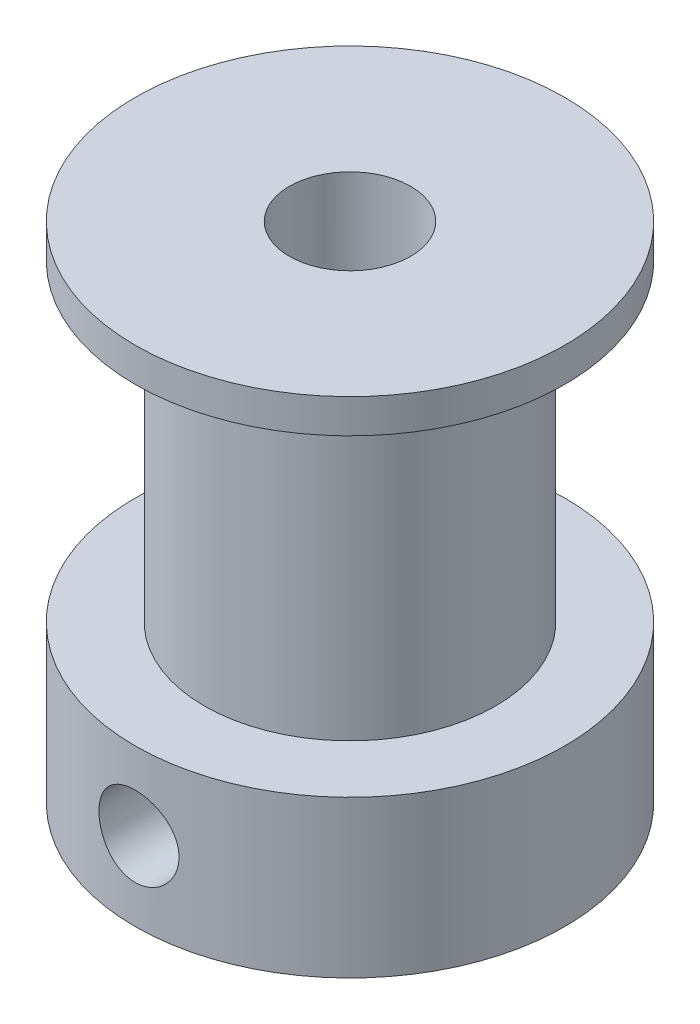
ISO-10303-21;
HEADER;
FILE_DESCRIPTION(('STEP AP214'),'2;1');
FILE_NAME('part.step','',(''),(''),'','','');
FILE_SCHEMA(('AUTOMOTIVE_DESIGN { 1 0 10303 214 1 1 1 1 }'));
ENDSEC;
DATA;
#1=APPLICATION_CONTEXT('core data for automotive mechanical design processes');
#2=APPLICATION_PROTOCOL_DEFINITION('international standard','automotive_design',2000,#1);
#3=PRODUCT_CONTEXT('',#1,'mechanical');
#4=PRODUCT('Part','Part','',(#3));
#5=PRODUCT_RELATED_PRODUCT_CATEGORY('part','',(#4));
#6=PRODUCT_DEFINITION_FORMATION('','',#4);
#7=PRODUCT_DEFINITION_CONTEXT('part definition',#1,'design');
#8=PRODUCT_DEFINITION('design','',#6,#7);
#9=PRODUCT_DEFINITION_SHAPE('','',#8);
#10=(LENGTH_UNIT() NAMED_UNIT(*) SI_UNIT(.MILLI.,.METRE.));
#11=(NAMED_UNIT(*) PLANE_ANGLE_UNIT() SI_UNIT($,.RADIAN.));
#12=(NAMED_UNIT(*) SI_UNIT($,.STERADIAN.) SOLID_ANGLE_UNIT());
#13=UNCERTAINTY_MEASURE_WITH_UNIT(LENGTH_MEASURE(1.E-05),#10,'distance_accuracy_value','');
#14=(GEOMETRIC_REPRESENTATION_CONTEXT(3) GLOBAL_UNCERTAINTY_ASSIGNED_CONTEXT((#13)) GLOBAL_UNIT_ASSIGNED_CONTEXT((#10,
#11,#12)) REPRESENTATION_CONTEXT('',''));
#15=CARTESIAN_POINT('',(0.,0.,0.));
#16=DIRECTION('',(0.,0.,1.));
#17=DIRECTION('',(1.,0.,0.));
#18=AXIS2_PLACEMENT_3D('',#15,#16,#17);
#19=CARTESIAN_POINT('',(0.,0.,0.));
#20=DIRECTION('',(0.,-1.,0.));
#21=DIRECTION('',(0.,0.,-1.));
#22=AXIS2_PLACEMENT_3D('',#19,#20,#21);
#23=CYLINDRICAL_SURFACE('',#22,2.5);
#24=CARTESIAN_POINT('',(-1.8781639970993,3.225,-1.65));
#25=CARTESIAN_POINT('',(-1.87817356740867,3.30579427655975,-1.64999443072167));
#26=CARTESIAN_POINT('',(-1.88347418282792,3.38662636905579,-1.64401449371116));
#27=CARTESIAN_POINT('',(-1.90365752241832,3.54541795060532,-1.62058860250623));
#28=CARTESIAN_POINT('',(-1.9185574504896,3.62337201591593,-1.60312206083479));
#29=CARTESIAN_POINT('',(-1.95530612756548,3.77363333158224,-1.55807727538571));
#30=CARTESIAN_POINT('',(-1.97708883218856,3.84598643150526,-1.53059477126484));
#31=CARTESIAN_POINT('',(-2.02503214275444,3.98494524738078,-1.46657517741326));
#32=CARTESIAN_POINT('',(-2.05119370638084,4.05154970122849,-1.43003610611277));
#33=CARTESIAN_POINT('',(-2.10971828562918,4.18821736687682,-1.342483593019));
#34=CARTESIAN_POINT('',(-2.14241946389367,4.25726727651007,-1.29011420470095));
#35=CARTESIAN_POINT('',(-2.20758221587981,4.38647714614391,-1.17514144468482));
#36=CARTESIAN_POINT('',(-2.24004353252863,4.44662860029669,-1.11252840012499));
#37=CARTESIAN_POINT('',(-2.3064419767716,4.56473271619889,-0.968234915676898));
#38=CARTESIAN_POINT('',(-2.33994640603816,4.62119090363769,-0.885111648041922));
#39=CARTESIAN_POINT('',(-2.39949293751456,4.71884115428655,-0.707908997031479));
#40=CARTESIAN_POINT('',(-2.42554320107045,4.76004992824281,-0.613841755901944));
#41=CARTESIAN_POINT('',(-2.46464353514927,4.82107361226671,-0.428365536633289));
#42=CARTESIAN_POINT('',(-2.47881191391302,4.84274914948944,-0.337811072451694));
#43=CARTESIAN_POINT('',(-2.49700266516609,4.87049014711654,-0.153380704926468));
#44=CARTESIAN_POINT('',(-2.50103745363967,4.87657471024375,-0.0595090091735767));
#45=CARTESIAN_POINT('',(-2.49868729659539,4.87300862462096,0.113712663637895));
#46=CARTESIAN_POINT('',(-2.49376656842582,4.86556933208685,0.193140500290932));
#47=CARTESIAN_POINT('',(-2.47671798966374,4.83953692457822,0.3493383081911));
#48=CARTESIAN_POINT('',(-2.46458960851095,4.8209429885018,0.426108083336214));
#49=CARTESIAN_POINT('',(-2.4341916732427,4.77358528412734,0.574862419576147));
#50=CARTESIAN_POINT('',(-2.41593946394568,4.74485022722838,0.646859815580448));
#51=CARTESIAN_POINT('',(-2.37464804586783,4.67831789592823,0.785017034503281));
#52=CARTESIAN_POINT('',(-2.35160793342518,4.64051891060689,0.851175752075152));
#53=CARTESIAN_POINT('',(-2.29902245001357,4.55144819163509,0.985047000791304));
#54=CARTESIAN_POINT('',(-2.26902056419845,4.49906230137878,1.05183695764555));
#55=CARTESIAN_POINT('',(-2.2070921891754,4.38519022775839,1.17625968695307));
#56=CARTESIAN_POINT('',(-2.17516278943165,4.32369006733423,1.2338781079658));
#57=CARTESIAN_POINT('',(-2.10711048312635,4.18250690257425,1.34724934289721));
#58=CARTESIAN_POINT('',(-2.07108428413496,4.10148069757491,1.40139996434746));
#59=CARTESIAN_POINT('',(-2.0043795765937,3.92947022283534,1.49525229324492));
#60=CARTESIAN_POINT('',(-1.973691925336,3.8385034211415,1.53497883258691));
#61=CARTESIAN_POINT('',(-1.93021206234819,3.67504901179961,1.58906609884216));
#62=CARTESIAN_POINT('',(-1.91481376393407,3.60458306194073,1.60742065844977));
#63=CARTESIAN_POINT('',(-1.89156962487726,3.46068483824098,1.63471528383588));
#64=CARTESIAN_POINT('',(-1.88371114115,3.38725774603094,1.64367111218457));
#65=CARTESIAN_POINT('',(-1.8767563549997,3.23913898103529,1.65161100823904));
#66=CARTESIAN_POINT('',(-1.87769482426888,3.16444345582033,1.65055550398266));
#67=CARTESIAN_POINT('',(-1.88825914723377,3.01646670785288,1.6384550878589));
#68=CARTESIAN_POINT('',(-1.89789215655036,2.94318670082213,1.62740194790476));
#69=CARTESIAN_POINT('',(-1.92377320788271,2.80315606994752,1.59670654181037));
#70=CARTESIAN_POINT('',(-1.9397182942886,2.7362601566981,1.57745493961547));
#71=CARTESIAN_POINT('',(-1.97637475195715,2.60658821030647,1.53127715983157));
#72=CARTESIAN_POINT('',(-1.99708770330354,2.54381355184297,1.50434843731629));
#73=CARTESIAN_POINT('',(-2.04592024038531,2.41084653371123,1.43744371796295));
#74=CARTESIAN_POINT('',(-2.0746933834994,2.34166627761783,1.3959374151933));
#75=CARTESIAN_POINT('',(-2.13386307226145,2.2104540035836,1.30370192953132));
#76=CARTESIAN_POINT('',(-2.16426156090022,2.14843083426984,1.2529615255776));
#77=CARTESIAN_POINT('',(-2.23066104299162,2.02002279309447,1.13132559349666));
#78=CARTESIAN_POINT('',(-2.26650752858329,1.95542825569478,1.0584336843705));
#79=CARTESIAN_POINT('',(-2.33354741548986,1.83929294484175,0.901029136145232));
#80=CARTESIAN_POINT('',(-2.36474520160667,1.78773983785047,0.816527594120797));
#81=CARTESIAN_POINT('',(-2.41383928477658,1.70846296196824,0.655022436944607));
#82=CARTESIAN_POINT('',(-2.43314294605933,1.67805320616478,0.579766982761487));
#83=CARTESIAN_POINT('',(-2.46500344203446,1.62840770004291,0.424305717798088));
#84=CARTESIAN_POINT('',(-2.47756592552064,1.60916259316718,0.344104114697706));
#85=CARTESIAN_POINT('',(-2.49483359194805,1.58280779187866,0.180532057501464));
#86=CARTESIAN_POINT('',(-2.49950622522129,1.57574836698325,0.0971499203467964));
#87=CARTESIAN_POINT('',(-2.50041880991432,1.57436521725825,-0.0697703046886496));
#88=CARTESIAN_POINT('',(-2.49665914509096,1.58004091284884,-0.153308385299506));
#89=CARTESIAN_POINT('',(-2.48162224491363,1.60295948175331,-0.31224884206867));
#90=CARTESIAN_POINT('',(-2.47086791156197,1.61939826797345,-0.387820405838241));
#91=CARTESIAN_POINT('',(-2.44325497490618,1.66222616352496,-0.534890956581204));
#92=CARTESIAN_POINT('',(-2.4263954123254,1.68861683656131,-0.606389301510793));
#93=CARTESIAN_POINT('',(-2.38659098522815,1.75225696718865,-0.748299731070002));
#94=CARTESIAN_POINT('',(-2.36333062488106,1.79008395318078,-0.818362050887261));
#95=CARTESIAN_POINT('',(-2.31298664760703,1.87460758414193,-0.951399734920284));
#96=CARTESIAN_POINT('',(-2.2859005630314,1.92130996063965,-1.0143704774724));
#97=CARTESIAN_POINT('',(-2.22528132748969,2.03052907515258,-1.14186276834818));
#98=CARTESIAN_POINT('',(-2.19140310364951,2.09437720174746,-1.20508031729177));
#99=CARTESIAN_POINT('',(-2.12387294022856,2.23156834044152,-1.32046767601713));
#100=CARTESIAN_POINT('',(-2.09022116132146,2.30491747200145,-1.37263030790415));
#101=CARTESIAN_POINT('',(-2.02963185186414,2.45297320198263,-1.46053735742483));
#102=CARTESIAN_POINT('',(-2.00236030827309,2.52689495776457,-1.49736813204505));
#103=CARTESIAN_POINT('',(-1.95397052678841,2.68110913288329,-1.55999123252305));
#104=CARTESIAN_POINT('',(-1.93283919103843,2.76138751989308,-1.58580711054237));
#105=CARTESIAN_POINT('',(-1.90415675714691,2.9056913968137,-1.62004735146957));
#106=CARTESIAN_POINT('',(-1.89451740482451,2.96864690760695,-1.63122690692698));
#107=CARTESIAN_POINT('',(-1.88151889606352,3.09606080182247,-1.64620346660995));
#108=CARTESIAN_POINT('',(-1.8781563590673,3.16051835732424,-1.65000444482246));
#109=CARTESIAN_POINT('',(-1.8781639970993,3.225,-1.65));
#110=B_SPLINE_CURVE_WITH_KNOTS('',3,(#24,#25,#26,#27,#28,#29,#30,#31,#32,#33,#34,#35,#36,#37,
#38,#39,#40,#41,#42,#43,#44,#45,#46,#47,#48,#49,#50,#51,#52,#53,#54,#55,#56,#57,#58,#59,#60,#61,
#62,#63,#64,#65,#66,#67,#68,#69,#70,#71,#72,#73,#74,#75,#76,#77,#78,#79,#80,#81,#82,#83,#84,#85,
#86,#87,#88,#89,#90,#91,#92,#93,#94,#95,#96,#97,#98,#99,#100,#101,#102,#103,#104,#105,#106,#107,
#108,#109),.UNSPECIFIED.,.T.,.F.,(4,2,2,2,2,2,2,2,2,2,2,2,2,2,2,2,2,2,2,2,2,2,2,2,2,2,2,2,2,2,2,
2,2,2,2,2,2,2,2,2,2,2,4),(0.,0.242089089232209,0.484613262365225,0.724877542229117,
0.965194438206264,1.24204242334406,1.5191533550871,1.83517136959404,2.1508420497088,
2.43163690958526,2.71208756281942,2.95071293244789,3.18935586962917,3.42732851395789,
3.66534611375403,3.93440451568683,4.20387988176699,4.51414003592554,4.82386349786489,
5.04625677123859,5.26827647088753,5.49117411610791,5.71425537389902,5.92772322794784,
6.14126192794924,6.39732261532281,6.65369656488882,6.9635657507811,7.27314078239636,
7.52238413686408,7.77141830954321,8.02147738775785,8.27152508592672,8.50474641601317,
8.73800440662634,8.98590102363144,9.23395827408608,9.52089661145361,9.80802068929721,
10.067982581361,10.327385800336,10.5207004402689,10.713910935025),.UNSPECIFIED.);
#111=CARTESIAN_POINT('',(-1.8781639970993,3.225,-1.65));
#112=VERTEX_POINT('',#111);
#113=EDGE_CURVE('E120',#112,#112,#110,.T.);
#114=ORIENTED_EDGE('',*,*,#113,.F.);
#115=EDGE_LOOP('',(#114));
#116=FACE_BOUND('',#115,.T.);
#117=CARTESIAN_POINT('',(-1.64999999999999,3.225,1.8781639970993));
#118=CARTESIAN_POINT('',(-1.64999443072166,3.30579427655975,1.87817356740867));
#119=CARTESIAN_POINT('',(-1.64401449371115,3.38662636905579,1.88347418282793));
#120=CARTESIAN_POINT('',(-1.62058860250622,3.54541795060532,1.90365752241832));
#121=CARTESIAN_POINT('',(-1.60312206083479,3.62337201591593,1.91855745048961));
#122=CARTESIAN_POINT('',(-1.5580772753857,3.77363333158224,1.95530612756548));
#123=CARTESIAN_POINT('',(-1.53059477126484,3.84598643150526,1.97708883218856));
#124=CARTESIAN_POINT('',(-1.46657517741325,3.98494524738078,2.02503214275445));
#125=CARTESIAN_POINT('',(-1.43003610611276,4.05154970122849,2.05119370638085));
#126=CARTESIAN_POINT('',(-1.34248359301899,4.18821736687682,2.10971828562919));
#127=CARTESIAN_POINT('',(-1.29011420470094,4.25726727651007,2.14241946389367));
#128=CARTESIAN_POINT('',(-1.17514144468481,4.38647714614391,2.20758221587982));
#129=CARTESIAN_POINT('',(-1.11252840012498,4.44662860029669,2.24004353252863));
#130=CARTESIAN_POINT('',(-0.968234915676889,4.56473271619889,2.3064419767716));
#131=CARTESIAN_POINT('',(-0.885111648041914,4.62119090363769,2.33994640603817));
#132=CARTESIAN_POINT('',(-0.70790899703147,4.71884115428655,2.39949293751456));
#133=CARTESIAN_POINT('',(-0.613841755901935,4.76004992824282,2.42554320107045));
#134=CARTESIAN_POINT('',(-0.42836553663328,4.82107361226671,2.46464353514927));
#135=CARTESIAN_POINT('',(-0.337811072451685,4.84274914948944,2.47881191391302));
#136=CARTESIAN_POINT('',(-0.153380704926458,4.87049014711654,2.49700266516609));
#137=CARTESIAN_POINT('',(-0.0595090091735671,4.87657471024375,2.50103745363967));
#138=CARTESIAN_POINT('',(0.113712663637905,4.87300862462096,2.49868729659539));
#139=CARTESIAN_POINT('',(0.193140500290941,4.86556933208685,2.49376656842582));
#140=CARTESIAN_POINT('',(0.349338308191109,4.83953692457822,2.47671798966374));
#141=CARTESIAN_POINT('',(0.426108083336223,4.8209429885018,2.46458960851095));
#142=CARTESIAN_POINT('',(0.574862419576157,4.77358528412734,2.4341916732427));
#143=CARTESIAN_POINT('',(0.646859815580457,4.74485022722838,2.41593946394568));
#144=CARTESIAN_POINT('',(0.78501703450329,4.67831789592823,2.37464804586783));
#145=CARTESIAN_POINT('',(0.851175752075161,4.64051891060689,2.35160793342517));
#146=CARTESIAN_POINT('',(0.985047000791314,4.55144819163509,2.29902245001356));
#147=CARTESIAN_POINT('',(1.05183695764556,4.49906230137878,2.26902056419845));
#148=CARTESIAN_POINT('',(1.17625968695308,4.38519022775838,2.20709218917539));
#149=CARTESIAN_POINT('',(1.23387810796581,4.32369006733423,2.17516278943164));
#150=CARTESIAN_POINT('',(1.34724934289721,4.18250690257425,2.10711048312634));
#151=CARTESIAN_POINT('',(1.40139996434747,4.10148069757491,2.07108428413495));
#152=CARTESIAN_POINT('',(1.49525229324493,3.92947022283534,2.00437957659369));
#153=CARTESIAN_POINT('',(1.53497883258691,3.8385034211415,1.973691925336));
#154=CARTESIAN_POINT('',(1.58906609884217,3.67504901179961,1.93021206234819));
#155=CARTESIAN_POINT('',(1.60742065844978,3.60458306194073,1.91481376393406));
#156=CARTESIAN_POINT('',(1.63471528383588,3.46068483824098,1.89156962487725));
#157=CARTESIAN_POINT('',(1.64367111218458,3.38725774603093,1.88371114115));
#158=CARTESIAN_POINT('',(1.65161100823905,3.23913898103529,1.8767563549997));
#159=CARTESIAN_POINT('',(1.65055550398267,3.16444345582033,1.87769482426888));
#160=CARTESIAN_POINT('',(1.63845508785891,3.01646670785288,1.88825914723377));
#161=CARTESIAN_POINT('',(1.62740194790476,2.94318670082213,1.89789215655036));
#162=CARTESIAN_POINT('',(1.59670654181038,2.80315606994752,1.92377320788271));
#163=CARTESIAN_POINT('',(1.57745493961548,2.7362601566981,1.9397182942886));
#164=CARTESIAN_POINT('',(1.53127715983158,2.60658821030647,1.97637475195714));
#165=CARTESIAN_POINT('',(1.50434843731629,2.54381355184297,1.99708770330354));
#166=CARTESIAN_POINT('',(1.43744371796296,2.41084653371123,2.0459202403853));
#167=CARTESIAN_POINT('',(1.39593741519331,2.34166627761783,2.07469338349939));
#168=CARTESIAN_POINT('',(1.30370192953132,2.2104540035836,2.13386307226145));
#169=CARTESIAN_POINT('',(1.25296152557761,2.14843083426984,2.16426156090021));
#170=CARTESIAN_POINT('',(1.13132559349666,2.02002279309446,2.23066104299161));
#171=CARTESIAN_POINT('',(1.0584336843705,1.95542825569478,2.26650752858329));
#172=CARTESIAN_POINT('',(0.901029136145238,1.83929294484174,2.33354741548986));
#173=CARTESIAN_POINT('',(0.816527594120802,1.78773983785047,2.36474520160667));
#174=CARTESIAN_POINT('',(0.655022436944612,1.70846296196824,2.41383928477658));
#175=CARTESIAN_POINT('',(0.579766982761492,1.67805320616478,2.43314294605933));
#176=CARTESIAN_POINT('',(0.424305717798094,1.62840770004291,2.46500344203446));
#177=CARTESIAN_POINT('',(0.344104114697712,1.60916259316718,2.47756592552063));
#178=CARTESIAN_POINT('',(0.18053205750147,1.58280779187866,2.49483359194805));
#179=CARTESIAN_POINT('',(0.0971499203468021,1.57574836698325,2.49950622522129));
#180=CARTESIAN_POINT('',(-0.0697703046886438,1.57436521725825,2.50041880991432));
#181=CARTESIAN_POINT('',(-0.1533083852995,1.58004091284884,2.49665914509096));
#182=CARTESIAN_POINT('',(-0.312248842068665,1.60295948175331,2.48162224491364));
#183=CARTESIAN_POINT('',(-0.387820405838235,1.61939826797345,2.47086791156197));
#184=CARTESIAN_POINT('',(-0.534890956581198,1.66222616352496,2.44325497490618));
#185=CARTESIAN_POINT('',(-0.606389301510787,1.68861683656131,2.4263954123254));
#186=CARTESIAN_POINT('',(-0.748299731069997,1.75225696718865,2.38659098522815));
#187=CARTESIAN_POINT('',(-0.818362050887255,1.79008395318078,2.36333062488106));
#188=CARTESIAN_POINT('',(-0.951399734920279,1.87460758414193,2.31298664760704));
#189=CARTESIAN_POINT('',(-1.01437047747239,1.92130996063965,2.2859005630314));
#190=CARTESIAN_POINT('',(-1.14186276834818,2.03052907515258,2.2252813274897));
#191=CARTESIAN_POINT('',(-1.20508031729177,2.09437720174746,2.19140310364951));
#192=CARTESIAN_POINT('',(-1.32046767601712,2.23156834044153,2.12387294022856));
#193=CARTESIAN_POINT('',(-1.37263030790415,2.30491747200145,2.09022116132146));
#194=CARTESIAN_POINT('',(-1.46053735742482,2.45297320198263,2.02963185186414));
#195=CARTESIAN_POINT('',(-1.49736813204505,2.52689495776457,2.00236030827309));
#196=CARTESIAN_POINT('',(-1.55999123252305,2.68110913288329,1.95397052678842));
#197=CARTESIAN_POINT('',(-1.58580711054236,2.76138751989309,1.93283919103844));
#198=CARTESIAN_POINT('',(-1.62004735146956,2.9056913968137,1.90415675714692));
#199=CARTESIAN_POINT('',(-1.63122690692697,2.96864690760695,1.89451740482452));
#200=CARTESIAN_POINT('',(-1.64620346660994,3.09606080182247,1.88151889606352));
#201=CARTESIAN_POINT('',(-1.65000444482246,3.16051835732424,1.87815635906731));
#202=CARTESIAN_POINT('',(-1.64999999999999,3.225,1.8781639970993));
#203=B_SPLINE_CURVE_WITH_KNOTS('',3,(#117,#118,#119,#120,#121,#122,#123,#124,#125,#126,#127,
#128,#129,#130,#131,#132,#133,#134,#135,#136,#137,#138,#139,#140,#141,#142,#143,#144,#145,#146,
#147,#148,#149,#150,#151,#152,#153,#154,#155,#156,#157,#158,#159,#160,#161,#162,#163,#164,#165,
#166,#167,#168,#169,#170,#171,#172,#173,#174,#175,#176,#177,#178,#179,#180,#181,#182,#183,#184,
#185,#186,#187,#188,#189,#190,#191,#192,#193,#194,#195,#196,#197,#198,#199,#200,#201,#202),
.UNSPECIFIED.,.T.,.F.,(4,2,2,2,2,2,2,2,2,2,2,2,2,2,2,2,2,2,2,2,2,2,2,2,2,2,2,2,2,2,2,2,2,2,2,2,
2,2,2,2,2,2,4),(0.,0.242089089232209,0.484613262365225,0.724877542229118,0.965194438206264,
1.24204242334406,1.5191533550871,1.83517136959404,2.1508420497088,2.43163690958526,
2.71208756281942,2.95071293244789,3.18935586962917,3.42732851395789,3.66534611375403,
3.93440451568684,4.20387988176699,4.51414003592554,4.82386349786489,5.04625677123859,
5.26827647088753,5.49117411610792,5.71425537389902,5.92772322794784,6.14126192794924,
6.39732261532282,6.65369656488882,6.9635657507811,7.27314078239636,7.52238413686409,
7.77141830954321,8.02147738775785,8.27152508592672,8.50474641601317,8.73800440662634,
8.98590102363144,9.23395827408609,9.52089661145361,9.80802068929721,10.067982581361,
10.327385800336,10.5207004402689,10.713910935025),.UNSPECIFIED.);
#204=CARTESIAN_POINT('',(-1.64999999999999,3.225,1.8781639970993));
#205=VERTEX_POINT('',#204);
#206=EDGE_CURVE('E64',#205,#205,#203,.T.);
#207=ORIENTED_EDGE('',*,*,#206,.F.);
#208=EDGE_LOOP('',(#207));
#209=FACE_BOUND('',#208,.T.);
#210=CARTESIAN_POINT('',(0.,0.,0.));
#211=DIRECTION('',(0.,-1.,0.));
#212=DIRECTION('',(0.,0.,-1.));
#213=AXIS2_PLACEMENT_3D('',#210,#211,#212);
#214=CIRCLE('',#213,2.5);
#215=CARTESIAN_POINT('',(0.,0.,-2.5));
#216=VERTEX_POINT('',#215);
#217=EDGE_CURVE('E61',#216,#216,#214,.T.);
#218=ORIENTED_EDGE('',*,*,#217,.T.);
#219=EDGE_LOOP('',(#218));
#220=FACE_BOUND('',#219,.T.);
#221=CARTESIAN_POINT('',(0.,20.75,0.));
#222=DIRECTION('',(0.,-1.,0.));
#223=DIRECTION('',(0.,0.,-1.));
#224=AXIS2_PLACEMENT_3D('',#221,#222,#223);
#225=CIRCLE('',#224,2.5);
#226=CARTESIAN_POINT('',(0.,20.75,-2.5));
#227=VERTEX_POINT('',#226);
#228=EDGE_CURVE('E10',#227,#227,#225,.T.);
#229=ORIENTED_EDGE('',*,*,#228,.F.);
#230=EDGE_LOOP('',(#229));
#231=FACE_BOUND('',#230,.T.);
#232=ADVANCED_FACE('F32',(#116,#209,#220,#231),#23,.F.);
#233=CARTESIAN_POINT('',(2.5,20.75,0.));
#234=DIRECTION('',(0.,1.,0.));
#235=DIRECTION('',(0.,0.,1.));
#236=AXIS2_PLACEMENT_3D('',#233,#234,#235);
#237=PLANE('',#236);
#238=ORIENTED_EDGE('',*,*,#228,.T.);
#239=EDGE_LOOP('',(#238));
#240=FACE_BOUND('',#239,.T.);
#241=CARTESIAN_POINT('',(0.,20.75,0.));
#242=DIRECTION('',(0.,-1.,0.));
#243=DIRECTION('',(0.,0.,-1.));
#244=AXIS2_PLACEMENT_3D('',#241,#242,#243);
#245=CIRCLE('',#244,8.85);
#246=CARTESIAN_POINT('',(0.,20.75,-8.85));
#247=VERTEX_POINT('',#246);
#248=EDGE_CURVE('E39',#247,#247,#245,.T.);
#249=ORIENTED_EDGE('',*,*,#248,.F.);
#250=EDGE_LOOP('',(#249));
#251=FACE_BOUND('',#250,.T.);
#252=ADVANCED_FACE('F108',(#240,#251),#237,.T.);
#253=CARTESIAN_POINT('',(0.,0.,0.));
#254=DIRECTION('',(0.,-1.,0.));
#255=DIRECTION('',(0.,0.,-1.));
#256=AXIS2_PLACEMENT_3D('',#253,#254,#255);
#257=CYLINDRICAL_SURFACE('',#256,8.85);
#258=ORIENTED_EDGE('',*,*,#248,.T.);
#259=EDGE_LOOP('',(#258));
#260=FACE_BOUND('',#259,.T.);
#261=CARTESIAN_POINT('',(0.,19.35,0.));
#262=DIRECTION('',(0.,-1.,0.));
#263=DIRECTION('',(0.,0.,-1.));
#264=AXIS2_PLACEMENT_3D('',#261,#262,#263);
#265=CIRCLE('',#264,8.85);
#266=CARTESIAN_POINT('',(0.,19.35,-8.85));
#267=VERTEX_POINT('',#266);
#268=EDGE_CURVE('E43',#267,#267,#265,.T.);
#269=ORIENTED_EDGE('',*,*,#268,.F.);
#270=EDGE_LOOP('',(#269));
#271=FACE_BOUND('',#270,.T.);
#272=ADVANCED_FACE('F105',(#260,#271),#257,.T.);
#273=CARTESIAN_POINT('',(8.85,19.35,0.));
#274=DIRECTION('',(0.,-1.,0.));
#275=DIRECTION('',(0.,0.,-1.));
#276=AXIS2_PLACEMENT_3D('',#273,#274,#275);
#277=PLANE('',#276);
#278=ORIENTED_EDGE('',*,*,#268,.T.);
#279=EDGE_LOOP('',(#278));
#280=FACE_BOUND('',#279,.T.);
#281=CARTESIAN_POINT('',(0.,19.35,0.));
#282=DIRECTION('',(0.,-1.,0.));
#283=DIRECTION('',(0.,0.,-1.));
#284=AXIS2_PLACEMENT_3D('',#281,#282,#283);
#285=CIRCLE('',#284,6.);
#286=CARTESIAN_POINT('',(0.,19.35,-6.));
#287=VERTEX_POINT('',#286);
#288=EDGE_CURVE('E47',#287,#287,#285,.T.);
#289=ORIENTED_EDGE('',*,*,#288,.F.);
#290=EDGE_LOOP('',(#289));
#291=FACE_BOUND('',#290,.T.);
#292=ADVANCED_FACE('F101',(#280,#291),#277,.T.);
#293=CARTESIAN_POINT('',(0.,0.,0.));
#294=DIRECTION('',(0.,-1.,0.));
#295=DIRECTION('',(0.,0.,-1.));
#296=AXIS2_PLACEMENT_3D('',#293,#294,#295);
#297=CYLINDRICAL_SURFACE('',#296,6.);
#298=ORIENTED_EDGE('',*,*,#288,.T.);
#299=EDGE_LOOP('',(#298));
#300=FACE_BOUND('',#299,.T.);
#301=CARTESIAN_POINT('',(0.,6.45,0.));
#302=DIRECTION('',(0.,-1.,0.));
#303=DIRECTION('',(0.,0.,-1.));
#304=AXIS2_PLACEMENT_3D('',#301,#302,#303);
#305=CIRCLE('',#304,6.);
#306=CARTESIAN_POINT('',(0.,6.45,-6.));
#307=VERTEX_POINT('',#306);
#308=EDGE_CURVE('E52',#307,#307,#305,.T.);
#309=ORIENTED_EDGE('',*,*,#308,.F.);
#310=EDGE_LOOP('',(#309));
#311=FACE_BOUND('',#310,.T.);
#312=ADVANCED_FACE('F97',(#300,#311),#297,.T.);
#313=CARTESIAN_POINT('',(6.,6.45,0.));
#314=DIRECTION('',(0.,1.,0.));
#315=DIRECTION('',(0.,0.,1.));
#316=AXIS2_PLACEMENT_3D('',#313,#314,#315);
#317=PLANE('',#316);
#318=ORIENTED_EDGE('',*,*,#308,.T.);
#319=EDGE_LOOP('',(#318));
#320=FACE_BOUND('',#319,.T.);
#321=CARTESIAN_POINT('',(0.,6.45,0.));
#322=DIRECTION('',(0.,-1.,0.));
#323=DIRECTION('',(0.,0.,-1.));
#324=AXIS2_PLACEMENT_3D('',#321,#322,#323);
#325=CIRCLE('',#324,8.85);
#326=CARTESIAN_POINT('',(0.,6.45,-8.85));
#327=VERTEX_POINT('',#326);
#328=EDGE_CURVE('E55',#327,#327,#325,.T.);
#329=ORIENTED_EDGE('',*,*,#328,.F.);
#330=EDGE_LOOP('',(#329));
#331=FACE_BOUND('',#330,.T.);
#332=ADVANCED_FACE('F93',(#320,#331),#317,.T.);
#333=CARTESIAN_POINT('',(0.,0.,0.));
#334=DIRECTION('',(0.,-1.,0.));
#335=DIRECTION('',(0.,0.,-1.));
#336=AXIS2_PLACEMENT_3D('',#333,#334,#335);
#337=CYLINDRICAL_SURFACE('',#336,8.85);
#338=CARTESIAN_POINT('',(-8.69482604771366,3.225,-1.65000000000002));
#339=CARTESIAN_POINT('',(-8.69482781961836,3.13318712551225,-1.64999646851443));
#340=CARTESIAN_POINT('',(-8.69629608283365,3.04132832099242,-1.64231072640125));
#341=CARTESIAN_POINT('',(-8.70200328524835,2.86020022456551,-1.61179115936412));
#342=CARTESIAN_POINT('',(-8.70624458573472,2.77093320732685,-1.58894442435651));
#343=CARTESIAN_POINT('',(-8.71700118617981,2.59763569117552,-1.52882830359618));
#344=CARTESIAN_POINT('',(-8.72351437901603,2.51360042476467,-1.49157227862262));
#345=CARTESIAN_POINT('',(-8.73807839736241,2.35297850515584,-1.40373041963031));
#346=CARTESIAN_POINT('',(-8.74612910005477,2.27639125773975,-1.35314565020235));
#347=CARTESIAN_POINT('',(-8.76297169239113,2.13189099300826,-1.23941864709532));
#348=CARTESIAN_POINT('',(-8.77177077636014,2.06408294233414,-1.17614408945541));
#349=CARTESIAN_POINT('',(-8.78905513475797,1.93998028874922,-1.03911962454139));
#350=CARTESIAN_POINT('',(-8.79754038866609,1.88368643764148,-0.965369033782185));
#351=CARTESIAN_POINT('',(-8.81331804879978,1.78380836630473,-0.808797051465479));
#352=CARTESIAN_POINT('',(-8.82060099132401,1.74032304599185,-0.725911535870358));
#353=CARTESIAN_POINT('',(-8.83307293463117,1.66793352616749,-0.553852864123929));
#354=CARTESIAN_POINT('',(-8.83826210561995,1.63902814138333,-0.464680219755369));
#355=CARTESIAN_POINT('',(-8.84591101367105,1.5969434064353,-0.283666132693808));
#356=CARTESIAN_POINT('',(-8.84840143451171,1.58358713603932,-0.191867140916775));
#357=CARTESIAN_POINT('',(-8.85047798041754,1.57242856772837,-0.00729976500797046));
#358=CARTESIAN_POINT('',(-8.85006435012314,1.57462495964029,0.0854685368106706));
#359=CARTESIAN_POINT('',(-8.84640339377218,1.59437356052834,0.268128074283779));
#360=CARTESIAN_POINT('',(-8.84319122195267,1.61173527536113,0.358040711914525));
#361=CARTESIAN_POINT('',(-8.8343335205522,1.66102047520029,0.533653730977177));
#362=CARTESIAN_POINT('',(-8.82868790303014,1.69294448646879,0.619353960054212));
#363=CARTESIAN_POINT('',(-8.81553884111321,1.77062999625587,0.784662740791316));
#364=CARTESIAN_POINT('',(-8.80802519842167,1.8164677695893,0.86423460340672));
#365=CARTESIAN_POINT('',(-8.7919712231604,1.92062345273677,1.01462834113705));
#366=CARTESIAN_POINT('',(-8.78343078735099,1.97894261796236,1.08544933493525));
#367=CARTESIAN_POINT('',(-8.76611656375867,2.10745571061062,1.2174594850533));
#368=CARTESIAN_POINT('',(-8.75734120124785,2.17781628665316,1.27848631073482));
#369=CARTESIAN_POINT('',(-8.74067002480942,2.32785944468152,1.38789759603455));
#370=CARTESIAN_POINT('',(-8.73277422346778,2.40754216002788,1.43628187475914));
#371=CARTESIAN_POINT('',(-8.71875394667089,2.57418148364569,1.51908012694809));
#372=CARTESIAN_POINT('',(-8.71263243982109,2.66114997214302,1.55347072569812));
#373=CARTESIAN_POINT('',(-8.70289948493759,2.83977036581416,1.60710640444723));
#374=CARTESIAN_POINT('',(-8.69928775595223,2.93142174553835,1.62635317972085));
#375=CARTESIAN_POINT('',(-8.69503880971876,3.11534307325788,1.64891830623663));
#376=CARTESIAN_POINT('',(-8.69435806245767,3.20758344347491,1.65246978029953));
#377=CARTESIAN_POINT('',(-8.69593169929538,3.39133926360538,1.6441682082256));
#378=CARTESIAN_POINT('',(-8.69818593996467,3.48285474872324,1.63231591485338));
#379=CARTESIAN_POINT('',(-8.7053350259378,3.66179798712419,1.59374330856129));
#380=CARTESIAN_POINT('',(-8.71020818991237,3.74925298707807,1.56714501727844));
#381=CARTESIAN_POINT('',(-8.72202738597335,3.9184650278529,1.49996483343461));
#382=CARTESIAN_POINT('',(-8.72897356932747,4.00022165232756,1.45938192038577));
#383=CARTESIAN_POINT('',(-8.74425537945855,4.15674374779096,1.36484721407609));
#384=CARTESIAN_POINT('',(-8.75260596783922,4.23141871699891,1.31074804031415));
#385=CARTESIAN_POINT('',(-8.76971351211558,4.37071509755618,1.1909154151686));
#386=CARTESIAN_POINT('',(-8.7784705040675,4.43533561464992,1.12518093003598));
#387=CARTESIAN_POINT('',(-8.79554392699136,4.55355864078241,0.982902890935281));
#388=CARTESIAN_POINT('',(-8.80385301579686,4.60700443476976,0.906228098094822));
#389=CARTESIAN_POINT('',(-8.81897119598209,4.70025530072996,0.744852397817091));
#390=CARTESIAN_POINT('',(-8.82578034464982,4.74006089370236,0.660151797090437));
#391=CARTESIAN_POINT('',(-8.83709984520675,4.80466632645883,0.485563559444987));
#392=CARTESIAN_POINT('',(-8.8416220090402,4.82954339698783,0.3957053007157));
#393=CARTESIAN_POINT('',(-8.84790837921588,4.86383221423075,0.212993840869886));
#394=CARTESIAN_POINT('',(-8.84967287233642,4.87324556906716,0.120140952198863));
#395=CARTESIAN_POINT('',(-8.85023947633553,4.87628427454869,-0.0644206011572592));
#396=CARTESIAN_POINT('',(-8.8490860170238,4.87014641151001,-0.156125314974752));
#397=CARTESIAN_POINT('',(-8.84403855830965,4.84277516860376,-0.337172528151278));
#398=CARTESIAN_POINT('',(-8.84014458454545,4.82154192995728,-0.426515049601113));
#399=CARTESIAN_POINT('',(-8.83005350199115,4.76468198415919,-0.600178469048796));
#400=CARTESIAN_POINT('',(-8.82386038468533,4.72908021257061,-0.684507777717209));
#401=CARTESIAN_POINT('',(-8.80984173169271,4.64452207324249,-0.846031236682501));
#402=CARTESIAN_POINT('',(-8.80201608830005,4.59556482431015,-0.923224915721279));
#403=CARTESIAN_POINT('',(-8.78545622022546,4.48486908910628,-1.06946650303304));
#404=CARTESIAN_POINT('',(-8.77671069725579,4.42295940583059,-1.1383835614211));
#405=CARTESIAN_POINT('',(-8.75936841281081,4.28847167859243,-1.2649327828544));
#406=CARTESIAN_POINT('',(-8.75077168679307,4.21589112989528,-1.32256228898502));
#407=CARTESIAN_POINT('',(-8.73461461878074,4.06132933365503,-1.42539442795117));
#408=CARTESIAN_POINT('',(-8.72706445726125,3.97926829636792,-1.47047878049901));
#409=CARTESIAN_POINT('',(-8.71397773582027,3.80862286667966,-1.54614967862008));
#410=CARTESIAN_POINT('',(-8.70843927038216,3.72004474355189,-1.57674995216177));
#411=CARTESIAN_POINT('',(-8.7011618261326,3.56350038828557,-1.61634203559836));
#412=CARTESIAN_POINT('',(-8.69879997010431,3.49645245910847,-1.62894221526526));
#413=CARTESIAN_POINT('',(-8.69563144400441,3.36127810312156,-1.64577239651984));
#414=CARTESIAN_POINT('',(-8.69482473244794,3.29315170512975,-1.65000262138364));
#415=CARTESIAN_POINT('',(-8.69482604771366,3.225,-1.65000000000002));
#416=B_SPLINE_CURVE_WITH_KNOTS('',3,(#338,#339,#340,#341,#342,#343,#344,#345,#346,#347,#348,
#349,#350,#351,#352,#353,#354,#355,#356,#357,#358,#359,#360,#361,#362,#363,#364,#365,#366,#367,
#368,#369,#370,#371,#372,#373,#374,#375,#376,#377,#378,#379,#380,#381,#382,#383,#384,#385,#386,
#387,#388,#389,#390,#391,#392,#393,#394,#395,#396,#397,#398,#399,#400,#401,#402,#403,#404,#405,
#406,#407,#408,#409,#410,#411,#412,#413,#414,#415),.UNSPECIFIED.,.T.,.F.,(4,2,2,2,2,2,2,2,2,2,2,
2,2,2,2,2,2,2,2,2,2,2,2,2,2,2,2,2,2,2,2,2,2,2,2,2,2,2,4),(0.,0.275189231168615,
0.550613096225518,0.825782188895181,1.10092930997352,1.37911056598153,1.65730997963981,
1.93760432688636,2.21787588399072,2.49492629867896,2.77195337461801,3.04554991158284,
3.31915633674794,3.59429061490545,3.86945257981618,4.14878682949561,4.42812507576014,
4.70792802533318,4.9876996479214,5.2633015385756,5.53888996138523,5.81223124033559,
6.08559246981063,6.3620754969727,6.63858310084262,6.91874099333438,7.19888818375445,
7.47757328709685,7.75622940722651,8.03066822563216,8.30510447662649,8.57906649708678,
8.85304659790226,9.1309069995889,9.40883272690785,9.68929631029677,9.96949353617282,
10.1737689796611,10.3780389738435),.UNSPECIFIED.);
#417=CARTESIAN_POINT('',(-8.69482604771366,3.225,-1.65000000000002));
#418=VERTEX_POINT('',#417);
#419=EDGE_CURVE('E130',#418,#418,#416,.T.);
#420=ORIENTED_EDGE('',*,*,#419,.F.);
#421=EDGE_LOOP('',(#420));
#422=FACE_BOUND('',#421,.T.);
#423=CARTESIAN_POINT('',(-1.64999999999999,3.225,8.69482604771367));
#424=CARTESIAN_POINT('',(-1.6499964685144,3.13318712551225,8.69482781961837));
#425=CARTESIAN_POINT('',(-1.64231072640122,3.04132832099242,8.69629608283366));
#426=CARTESIAN_POINT('',(-1.61179115936409,2.86020022456551,8.70200328524835));
#427=CARTESIAN_POINT('',(-1.58894442435648,2.77093320732685,8.70624458573473));
#428=CARTESIAN_POINT('',(-1.52882830359615,2.59763569117552,8.71700118617981));
#429=CARTESIAN_POINT('',(-1.49157227862258,2.51360042476467,8.72351437901603));
#430=CARTESIAN_POINT('',(-1.40373041963028,2.35297850515584,8.73807839736241));
#431=CARTESIAN_POINT('',(-1.35314565020232,2.27639125773975,8.74612910005477));
#432=CARTESIAN_POINT('',(-1.23941864709529,2.13189099300826,8.76297169239114));
#433=CARTESIAN_POINT('',(-1.17614408945538,2.06408294233414,8.77177077636014));
#434=CARTESIAN_POINT('',(-1.03911962454136,1.93998028874922,8.78905513475797));
#435=CARTESIAN_POINT('',(-0.965369033782154,1.88368643764148,8.7975403886661));
#436=CARTESIAN_POINT('',(-0.808797051465449,1.78380836630473,8.81331804879978));
#437=CARTESIAN_POINT('',(-0.725911535870327,1.74032304599185,8.82060099132401));
#438=CARTESIAN_POINT('',(-0.553852864123899,1.66793352616749,8.83307293463118));
#439=CARTESIAN_POINT('',(-0.464680219755338,1.63902814138333,8.83826210561995));
#440=CARTESIAN_POINT('',(-0.283666132693777,1.5969434064353,8.84591101367105));
#441=CARTESIAN_POINT('',(-0.191867140916745,1.58358713603932,8.84840143451171));
#442=CARTESIAN_POINT('',(-0.00729976500793966,1.57242856772837,8.85047798041754));
#443=CARTESIAN_POINT('',(0.0854685368107014,1.57462495964029,8.85006435012314));
#444=CARTESIAN_POINT('',(0.26812807428381,1.59437356052834,8.84640339377218));
#445=CARTESIAN_POINT('',(0.358040711914556,1.61173527536113,8.84319122195267));
#446=CARTESIAN_POINT('',(0.533653730977208,1.66102047520029,8.8343335205522));
#447=CARTESIAN_POINT('',(0.619353960054243,1.69294448646879,8.82868790303014));
#448=CARTESIAN_POINT('',(0.784662740791348,1.77062999625587,8.81553884111321));
#449=CARTESIAN_POINT('',(0.864234603406751,1.8164677695893,8.80802519842167));
#450=CARTESIAN_POINT('',(1.01462834113708,1.92062345273677,8.7919712231604));
#451=CARTESIAN_POINT('',(1.08544933493528,1.97894261796236,8.78343078735099));
#452=CARTESIAN_POINT('',(1.21745948505333,2.10745571061062,8.76611656375866));
#453=CARTESIAN_POINT('',(1.27848631073486,2.17781628665316,8.75734120124784));
#454=CARTESIAN_POINT('',(1.38789759603458,2.32785944468152,8.74067002480941));
#455=CARTESIAN_POINT('',(1.43628187475917,2.40754216002788,8.73277422346778));
#456=CARTESIAN_POINT('',(1.51908012694812,2.57418148364569,8.71875394667089));
#457=CARTESIAN_POINT('',(1.55347072569815,2.66114997214302,8.71263243982108));
#458=CARTESIAN_POINT('',(1.60710640444726,2.83977036581416,8.70289948493758));
#459=CARTESIAN_POINT('',(1.62635317972088,2.93142174553835,8.69928775595222));
#460=CARTESIAN_POINT('',(1.64891830623666,3.11534307325788,8.69503880971875));
#461=CARTESIAN_POINT('',(1.65246978029956,3.20758344347491,8.69435806245766));
#462=CARTESIAN_POINT('',(1.64416820822564,3.39133926360538,8.69593169929537));
#463=CARTESIAN_POINT('',(1.63231591485342,3.48285474872324,8.69818593996466));
#464=CARTESIAN_POINT('',(1.59374330856132,3.66179798712419,8.7053350259378));
#465=CARTESIAN_POINT('',(1.56714501727847,3.74925298707808,8.71020818991237));
#466=CARTESIAN_POINT('',(1.49996483343464,3.9184650278529,8.72202738597334));
#467=CARTESIAN_POINT('',(1.4593819203858,4.00022165232756,8.72897356932746));
#468=CARTESIAN_POINT('',(1.36484721407612,4.15674374779096,8.74425537945855));
#469=CARTESIAN_POINT('',(1.31074804031418,4.23141871699891,8.75260596783921));
#470=CARTESIAN_POINT('',(1.19091541516863,4.37071509755618,8.76971351211557));
#471=CARTESIAN_POINT('',(1.12518093003601,4.43533561464992,8.77847050406749));
#472=CARTESIAN_POINT('',(0.982902890935312,4.55355864078241,8.79554392699136));
#473=CARTESIAN_POINT('',(0.906228098094853,4.60700443476976,8.80385301579685));
#474=CARTESIAN_POINT('',(0.744852397817122,4.70025530072996,8.81897119598209));
#475=CARTESIAN_POINT('',(0.660151797090468,4.74006089370236,8.82578034464982));
#476=CARTESIAN_POINT('',(0.485563559445018,4.80466632645883,8.83709984520675));
#477=CARTESIAN_POINT('',(0.395705300715731,4.82954339698783,8.84162200904019));
#478=CARTESIAN_POINT('',(0.212993840869918,4.86383221423075,8.84790837921588));
#479=CARTESIAN_POINT('',(0.120140952198894,4.87324556906716,8.84967287233641));
#480=CARTESIAN_POINT('',(-0.0644206011572275,4.87628427454869,8.85023947633553));
#481=CARTESIAN_POINT('',(-0.15612531497472,4.87014641151001,8.8490860170238));
#482=CARTESIAN_POINT('',(-0.337172528151246,4.84277516860376,8.84403855830965));
#483=CARTESIAN_POINT('',(-0.426515049601082,4.82154192995728,8.84014458454545));
#484=CARTESIAN_POINT('',(-0.600178469048764,4.76468198415918,8.83005350199115));
#485=CARTESIAN_POINT('',(-0.684507777717177,4.72908021257061,8.82386038468533));
#486=CARTESIAN_POINT('',(-0.84603123668247,4.64452207324249,8.80984173169271));
#487=CARTESIAN_POINT('',(-0.923224915721247,4.59556482431015,8.80201608830006));
#488=CARTESIAN_POINT('',(-1.06946650303301,4.48486908910628,8.78545622022546));
#489=CARTESIAN_POINT('',(-1.13838356142107,4.42295940583059,8.77671069725579));
#490=CARTESIAN_POINT('',(-1.26493278285437,4.28847167859243,8.75936841281082));
#491=CARTESIAN_POINT('',(-1.32256228898499,4.21589112989528,8.75077168679308));
#492=CARTESIAN_POINT('',(-1.42539442795114,4.06132933365503,8.73461461878074));
#493=CARTESIAN_POINT('',(-1.47047878049898,3.97926829636792,8.72706445726126));
#494=CARTESIAN_POINT('',(-1.54614967862005,3.80862286667966,8.71397773582027));
#495=CARTESIAN_POINT('',(-1.57674995216174,3.72004474355189,8.70843927038216));
#496=CARTESIAN_POINT('',(-1.61634203559833,3.56350038828557,8.7011618261326));
#497=CARTESIAN_POINT('',(-1.62894221526523,3.49645245910847,8.69879997010431));
#498=CARTESIAN_POINT('',(-1.64577239651981,3.36127810312156,8.69563144400442));
#499=CARTESIAN_POINT('',(-1.65000262138361,3.29315170512975,8.69482473244794));
#500=CARTESIAN_POINT('',(-1.64999999999999,3.225,8.69482604771367));
#501=B_SPLINE_CURVE_WITH_KNOTS('',3,(#423,#424,#425,#426,#427,#428,#429,#430,#431,#432,#433,
#434,#435,#436,#437,#438,#439,#440,#441,#442,#443,#444,#445,#446,#447,#448,#449,#450,#451,#452,
#453,#454,#455,#456,#457,#458,#459,#460,#461,#462,#463,#464,#465,#466,#467,#468,#469,#470,#471,
#472,#473,#474,#475,#476,#477,#478,#479,#480,#481,#482,#483,#484,#485,#486,#487,#488,#489,#490,
#491,#492,#493,#494,#495,#496,#497,#498,#499,#500),.UNSPECIFIED.,.T.,.F.,(4,2,2,2,2,2,2,2,2,2,2,
2,2,2,2,2,2,2,2,2,2,2,2,2,2,2,2,2,2,2,2,2,2,2,2,2,2,2,4),(0.,0.275189231168615,
0.550613096225518,0.825782188895181,1.10092930997352,1.37911056598153,1.65730997963981,
1.93760432688636,2.21787588399072,2.49492629867896,2.77195337461801,3.04554991158284,
3.31915633674794,3.59429061490545,3.86945257981618,4.14878682949561,4.42812507576014,
4.70792802533318,4.9876996479214,5.2633015385756,5.53888996138523,5.81223124033559,
6.08559246981063,6.3620754969727,6.63858310084262,6.91874099333438,7.19888818375445,
7.47757328709685,7.75622940722651,8.03066822563216,8.30510447662649,8.57906649708677,
8.85304659790226,9.1309069995889,9.40883272690785,9.68929631029677,9.96949353617282,
10.1737689796611,10.3780389738435),.UNSPECIFIED.);
#502=CARTESIAN_POINT('',(-1.64999999999999,3.225,8.69482604771367));
#503=VERTEX_POINT('',#502);
#504=EDGE_CURVE('E70',#503,#503,#501,.T.);
#505=ORIENTED_EDGE('',*,*,#504,.F.);
#506=EDGE_LOOP('',(#505));
#507=FACE_BOUND('',#506,.T.);
#508=ORIENTED_EDGE('',*,*,#328,.T.);
#509=EDGE_LOOP('',(#508));
#510=FACE_BOUND('',#509,.T.);
#511=CARTESIAN_POINT('',(0.,0.,0.));
#512=DIRECTION('',(0.,-1.,0.));
#513=DIRECTION('',(0.,0.,-1.));
#514=AXIS2_PLACEMENT_3D('',#511,#512,#513);
#515=CIRCLE('',#514,8.85);
#516=CARTESIAN_POINT('',(0.,0.,-8.85));
#517=VERTEX_POINT('',#516);
#518=EDGE_CURVE('E58',#517,#517,#515,.T.);
#519=ORIENTED_EDGE('',*,*,#518,.F.);
#520=EDGE_LOOP('',(#519));
#521=FACE_BOUND('',#520,.T.);
#522=ADVANCED_FACE('F89',(#422,#507,#510,#521),#337,.T.);
#523=CARTESIAN_POINT('',(8.85,0.,0.));
#524=DIRECTION('',(0.,-1.,0.));
#525=DIRECTION('',(0.,0.,-1.));
#526=AXIS2_PLACEMENT_3D('',#523,#524,#525);
#527=PLANE('',#526);
#528=ORIENTED_EDGE('',*,*,#518,.T.);
#529=EDGE_LOOP('',(#528));
#530=FACE_BOUND('',#529,.T.);
#531=ORIENTED_EDGE('',*,*,#217,.F.);
#532=EDGE_LOOP('',(#531));
#533=FACE_BOUND('',#532,.T.);
#534=ADVANCED_FACE('F80',(#530,#533),#527,.T.);
#535=CARTESIAN_POINT('',(0.,3.225,0.));
#536=DIRECTION('',(0.,0.,-1.));
#537=DIRECTION('',(-1.,0.,0.));
#538=AXIS2_PLACEMENT_3D('',#535,#536,#537);
#539=CYLINDRICAL_SURFACE('',#538,1.64999999999999);
#540=ORIENTED_EDGE('',*,*,#206,.T.);
#541=EDGE_LOOP('',(#540));
#542=FACE_BOUND('',#541,.T.);
#543=ORIENTED_EDGE('',*,*,#504,.T.);
#544=EDGE_LOOP('',(#543));
#545=FACE_BOUND('',#544,.T.);
#546=ADVANCED_FACE('F75',(#542,#545),#539,.F.);
#547=CARTESIAN_POINT('',(0.,3.225,0.));
#548=DIRECTION('',(1.,0.,0.));
#549=DIRECTION('',(0.,0.,-1.));
#550=AXIS2_PLACEMENT_3D('',#547,#548,#549);
#551=CYLINDRICAL_SURFACE('',#550,1.64999999999999);
#552=ORIENTED_EDGE('',*,*,#113,.T.);
#553=EDGE_LOOP('',(#552));
#554=FACE_BOUND('',#553,.T.);
#555=ORIENTED_EDGE('',*,*,#419,.T.);
#556=EDGE_LOOP('',(#555));
#557=FACE_BOUND('',#556,.T.);
#558=ADVANCED_FACE('F79',(#554,#557),#551,.F.);
#559=CLOSED_SHELL('',(#232,#252,#272,#292,#312,#332,#522,#534,#546,#558));
#560=MANIFOLD_SOLID_BREP('B2',#559);
#561=ADVANCED_BREP_SHAPE_REPRESENTATION('',(#18,#560),#14);
#562=SHAPE_DEFINITION_REPRESENTATION(#9,#561);
ENDSEC;
END-ISO-10303-21;
